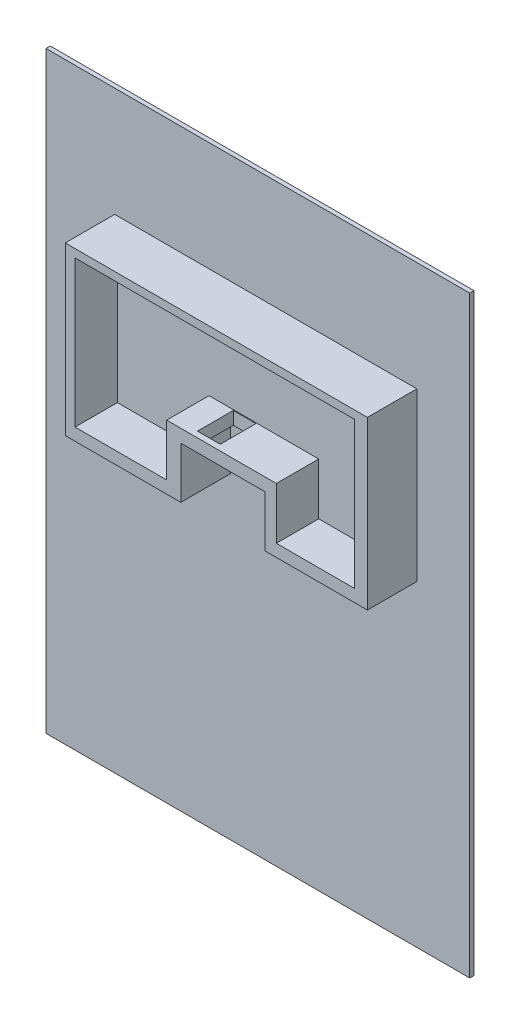
ISO-10303-21;
HEADER;
FILE_DESCRIPTION(('STEP AP214'),'2;1');
FILE_NAME('part.step','',(''),(''),'','','');
FILE_SCHEMA(('AUTOMOTIVE_DESIGN { 1 0 10303 214 1 1 1 1 }'));
ENDSEC;
DATA;
#1=APPLICATION_CONTEXT('core data for automotive mechanical design processes');
#2=APPLICATION_PROTOCOL_DEFINITION('international standard','automotive_design',2000,#1);
#3=PRODUCT_CONTEXT('',#1,'mechanical');
#4=PRODUCT('Part','Part','',(#3));
#5=PRODUCT_RELATED_PRODUCT_CATEGORY('part','',(#4));
#6=PRODUCT_DEFINITION_FORMATION('','',#4);
#7=PRODUCT_DEFINITION_CONTEXT('part definition',#1,'design');
#8=PRODUCT_DEFINITION('design','',#6,#7);
#9=PRODUCT_DEFINITION_SHAPE('','',#8);
#10=(LENGTH_UNIT() NAMED_UNIT(*) SI_UNIT(.MILLI.,.METRE.));
#11=(NAMED_UNIT(*) PLANE_ANGLE_UNIT() SI_UNIT($,.RADIAN.));
#12=(NAMED_UNIT(*) SI_UNIT($,.STERADIAN.) SOLID_ANGLE_UNIT());
#13=UNCERTAINTY_MEASURE_WITH_UNIT(LENGTH_MEASURE(1.E-05),#10,'distance_accuracy_value','');
#14=(GEOMETRIC_REPRESENTATION_CONTEXT(3) GLOBAL_UNCERTAINTY_ASSIGNED_CONTEXT((#13)) GLOBAL_UNIT_ASSIGNED_CONTEXT((#10,
#11,#12)) REPRESENTATION_CONTEXT('',''));
#15=CARTESIAN_POINT('',(0.,0.,0.));
#16=DIRECTION('',(0.,0.,1.));
#17=DIRECTION('',(1.,0.,0.));
#18=AXIS2_PLACEMENT_3D('',#15,#16,#17);
#19=CARTESIAN_POINT('',(0.,0.,300.));
#20=DIRECTION('',(0.,0.,1.));
#21=DIRECTION('',(1.,0.,0.));
#22=AXIS2_PLACEMENT_3D('',#19,#20,#21);
#23=PLANE('',#22);
#24=DIRECTION('',(0.,-1.,0.));
#25=VECTOR('',#24,1.);
#26=CARTESIAN_POINT('',(-13806.8006711639,5017.15265866209,300.));
#27=LINE('',#26,#25);
#28=CARTESIAN_POINT('',(-13806.8006711639,5017.15265866209,300.));
#29=VERTEX_POINT('',#28);
#30=CARTESIAN_POINT('',(-13806.8006711639,-36982.8473413379,300.));
#31=VERTEX_POINT('',#30);
#32=EDGE_CURVE('E350',#29,#31,#27,.T.);
#33=ORIENTED_EDGE('',*,*,#32,.T.);
#34=DIRECTION('',(1.,0.,0.));
#35=VECTOR('',#34,1.);
#36=CARTESIAN_POINT('',(-13806.8006711639,-36982.8473413379,300.));
#37=LINE('',#36,#35);
#38=CARTESIAN_POINT('',(16193.1993288361,-36982.8473413379,300.));
#39=VERTEX_POINT('',#38);
#40=EDGE_CURVE('E353',#31,#39,#37,.T.);
#41=ORIENTED_EDGE('',*,*,#40,.T.);
#42=DIRECTION('',(0.,1.,0.));
#43=VECTOR('',#42,1.);
#44=CARTESIAN_POINT('',(16193.1993288361,5017.15265866209,300.));
#45=LINE('',#44,#43);
#46=CARTESIAN_POINT('',(16193.1993288361,5017.15265866209,300.));
#47=VERTEX_POINT('',#46);
#48=EDGE_CURVE('E356',#39,#47,#45,.T.);
#49=ORIENTED_EDGE('',*,*,#48,.T.);
#50=DIRECTION('',(-1.,0.,0.));
#51=VECTOR('',#50,1.);
#52=CARTESIAN_POINT('',(-13806.8006711639,5017.15265866209,300.));
#53=LINE('',#52,#51);
#54=EDGE_CURVE('E358',#47,#29,#53,.T.);
#55=ORIENTED_EDGE('',*,*,#54,.T.);
#56=EDGE_LOOP('',(#33,#41,#49,#55));
#57=FACE_BOUND('',#56,.T.);
#58=DIRECTION('',(-1.,0.,0.));
#59=VECTOR('',#58,1.);
#60=CARTESIAN_POINT('',(0.,-14541.0624681403,300.));
#61=LINE('',#60,#59);
#62=CARTESIAN_POINT('',(-760.186628399339,-14541.0624681403,300.));
#63=VERTEX_POINT('',#62);
#64=CARTESIAN_POINT('',(-8945.80397300491,-14541.0624681403,300.));
#65=VERTEX_POINT('',#64);
#66=EDGE_CURVE('E343',#63,#65,#61,.T.);
#67=ORIENTED_EDGE('',*,*,#66,.T.);
#68=DIRECTION('',(0.,1.,0.));
#69=VECTOR('',#68,1.);
#70=CARTESIAN_POINT('',(-8945.80397300491,0.,300.));
#71=LINE('',#70,#69);
#72=CARTESIAN_POINT('',(-8945.80397300491,-2727.72834581182,300.));
#73=VERTEX_POINT('',#72);
#74=EDGE_CURVE('E346',#65,#73,#71,.T.);
#75=ORIENTED_EDGE('',*,*,#74,.T.);
#76=DIRECTION('',(1.,0.,0.));
#77=VECTOR('',#76,1.);
#78=CARTESIAN_POINT('',(0.,-2727.72834581182,300.));
#79=LINE('',#78,#77);
#80=CARTESIAN_POINT('',(12448.4231776688,-2727.72834581182,300.));
#81=VERTEX_POINT('',#80);
#82=EDGE_CURVE('E325',#73,#81,#79,.T.);
#83=ORIENTED_EDGE('',*,*,#82,.T.);
#84=DIRECTION('',(0.,-1.,0.));
#85=VECTOR('',#84,1.);
#86=CARTESIAN_POINT('',(12448.4231776688,0.,300.));
#87=LINE('',#86,#85);
#88=CARTESIAN_POINT('',(12448.4231776688,-14541.0624681403,300.));
#89=VERTEX_POINT('',#88);
#90=EDGE_CURVE('E328',#81,#89,#87,.T.);
#91=ORIENTED_EDGE('',*,*,#90,.T.);
#92=DIRECTION('',(-1.,0.,0.));
#93=VECTOR('',#92,1.);
#94=CARTESIAN_POINT('',(0.,-14541.0624681403,300.));
#95=LINE('',#94,#93);
#96=CARTESIAN_POINT('',(5192.98962222291,-14541.0624681403,300.));
#97=VERTEX_POINT('',#96);
#98=EDGE_CURVE('E331',#89,#97,#95,.T.);
#99=ORIENTED_EDGE('',*,*,#98,.T.);
#100=DIRECTION('',(0.,1.,0.));
#101=VECTOR('',#100,1.);
#102=CARTESIAN_POINT('',(5192.98962222291,0.,300.));
#103=LINE('',#102,#101);
#104=CARTESIAN_POINT('',(5192.98962222291,-10913.3456904174,300.));
#105=VERTEX_POINT('',#104);
#106=EDGE_CURVE('E334',#97,#105,#103,.T.);
#107=ORIENTED_EDGE('',*,*,#106,.T.);
#108=DIRECTION('',(-1.,0.,0.));
#109=VECTOR('',#108,1.);
#110=CARTESIAN_POINT('',(0.,-10913.3456904174,300.));
#111=LINE('',#110,#109);
#112=CARTESIAN_POINT('',(-760.186628399339,-10913.3456904174,300.));
#113=VERTEX_POINT('',#112);
#114=EDGE_CURVE('E337',#105,#113,#111,.T.);
#115=ORIENTED_EDGE('',*,*,#114,.T.);
#116=DIRECTION('',(0.,-1.,0.));
#117=VECTOR('',#116,1.);
#118=CARTESIAN_POINT('',(-760.186628399339,0.,300.));
#119=LINE('',#118,#117);
#120=EDGE_CURVE('E340',#113,#63,#119,.T.);
#121=ORIENTED_EDGE('',*,*,#120,.T.);
#122=EDGE_LOOP('',(#67,#75,#83,#91,#99,#107,#115,#121));
#123=FACE_BOUND('',#122,.T.);
#124=ADVANCED_FACE('F33',(#57,#123),#23,.T.);
#125=CARTESIAN_POINT('',(-13806.8006711639,5017.15265866209,300.));
#126=DIRECTION('',(1.,0.,0.));
#127=DIRECTION('',(0.,1.,0.));
#128=AXIS2_PLACEMENT_3D('',#125,#126,#127);
#129=PLANE('',#128);
#130=DIRECTION('',(0.,-1.,0.));
#131=VECTOR('',#130,1.);
#132=CARTESIAN_POINT('',(-13806.8006711639,5017.15265866209,0.));
#133=LINE('',#132,#131);
#134=CARTESIAN_POINT('',(-13806.8006711639,5017.15265866209,0.));
#135=VERTEX_POINT('',#134);
#136=CARTESIAN_POINT('',(-13806.8006711639,-36982.8473413379,0.));
#137=VERTEX_POINT('',#136);
#138=EDGE_CURVE('E349',#135,#137,#133,.T.);
#139=ORIENTED_EDGE('',*,*,#138,.T.);
#140=DIRECTION('',(0.,0.,-1.));
#141=VECTOR('',#140,1.);
#142=CARTESIAN_POINT('',(-13806.8006711639,-36982.8473413379,300.));
#143=LINE('',#142,#141);
#144=EDGE_CURVE('E376',#31,#137,#143,.T.);
#145=ORIENTED_EDGE('',*,*,#144,.F.);
#146=ORIENTED_EDGE('',*,*,#32,.F.);
#147=DIRECTION('',(0.,0.,-1.));
#148=VECTOR('',#147,1.);
#149=CARTESIAN_POINT('',(-13806.8006711639,5017.15265866209,300.));
#150=LINE('',#149,#148);
#151=EDGE_CURVE('E360',#29,#135,#150,.T.);
#152=ORIENTED_EDGE('',*,*,#151,.T.);
#153=EDGE_LOOP('',(#139,#145,#146,#152));
#154=FACE_BOUND('',#153,.T.);
#155=ADVANCED_FACE('F35',(#154),#129,.F.);
#156=CARTESIAN_POINT('',(-13806.8006711639,-36982.8473413379,300.));
#157=DIRECTION('',(0.,1.,0.));
#158=DIRECTION('',(0.,0.,1.));
#159=AXIS2_PLACEMENT_3D('',#156,#157,#158);
#160=PLANE('',#159);
#161=DIRECTION('',(1.,0.,0.));
#162=VECTOR('',#161,1.);
#163=CARTESIAN_POINT('',(-13806.8006711639,-36982.8473413379,0.));
#164=LINE('',#163,#162);
#165=CARTESIAN_POINT('',(16193.1993288361,-36982.8473413379,0.));
#166=VERTEX_POINT('',#165);
#167=EDGE_CURVE('E363',#137,#166,#164,.T.);
#168=ORIENTED_EDGE('',*,*,#167,.T.);
#169=DIRECTION('',(0.,0.,-1.));
#170=VECTOR('',#169,1.);
#171=CARTESIAN_POINT('',(16193.1993288361,-36982.8473413379,300.));
#172=LINE('',#171,#170);
#173=EDGE_CURVE('E373',#39,#166,#172,.T.);
#174=ORIENTED_EDGE('',*,*,#173,.F.);
#175=ORIENTED_EDGE('',*,*,#40,.F.);
#176=ORIENTED_EDGE('',*,*,#144,.T.);
#177=EDGE_LOOP('',(#168,#174,#175,#176));
#178=FACE_BOUND('',#177,.T.);
#179=ADVANCED_FACE('F409',(#178),#160,.F.);
#180=CARTESIAN_POINT('',(16193.1993288361,5017.15265866209,300.));
#181=DIRECTION('',(-1.,0.,0.));
#182=DIRECTION('',(0.,-1.,0.));
#183=AXIS2_PLACEMENT_3D('',#180,#181,#182);
#184=PLANE('',#183);
#185=DIRECTION('',(0.,1.,0.));
#186=VECTOR('',#185,1.);
#187=CARTESIAN_POINT('',(16193.1993288361,5017.15265866209,0.));
#188=LINE('',#187,#186);
#189=CARTESIAN_POINT('',(16193.1993288361,5017.15265866209,0.));
#190=VERTEX_POINT('',#189);
#191=EDGE_CURVE('E365',#166,#190,#188,.T.);
#192=ORIENTED_EDGE('',*,*,#191,.T.);
#193=DIRECTION('',(0.,0.,-1.));
#194=VECTOR('',#193,1.);
#195=CARTESIAN_POINT('',(16193.1993288361,5017.15265866209,300.));
#196=LINE('',#195,#194);
#197=EDGE_CURVE('E370',#47,#190,#196,.T.);
#198=ORIENTED_EDGE('',*,*,#197,.F.);
#199=ORIENTED_EDGE('',*,*,#48,.F.);
#200=ORIENTED_EDGE('',*,*,#173,.T.);
#201=EDGE_LOOP('',(#192,#198,#199,#200));
#202=FACE_BOUND('',#201,.T.);
#203=ADVANCED_FACE('F423',(#202),#184,.F.);
#204=CARTESIAN_POINT('',(-13806.8006711639,5017.15265866209,300.));
#205=DIRECTION('',(0.,-1.,0.));
#206=DIRECTION('',(0.,0.,-1.));
#207=AXIS2_PLACEMENT_3D('',#204,#205,#206);
#208=PLANE('',#207);
#209=DIRECTION('',(-1.,0.,0.));
#210=VECTOR('',#209,1.);
#211=CARTESIAN_POINT('',(-13806.8006711639,5017.15265866209,0.));
#212=LINE('',#211,#210);
#213=EDGE_CURVE('E354',#190,#135,#212,.T.);
#214=ORIENTED_EDGE('',*,*,#213,.T.);
#215=ORIENTED_EDGE('',*,*,#151,.F.);
#216=ORIENTED_EDGE('',*,*,#54,.F.);
#217=ORIENTED_EDGE('',*,*,#197,.T.);
#218=EDGE_LOOP('',(#214,#215,#216,#217));
#219=FACE_BOUND('',#218,.T.);
#220=ADVANCED_FACE('F419',(#219),#208,.F.);
#221=CARTESIAN_POINT('',(0.,0.,0.));
#222=DIRECTION('',(0.,0.,1.));
#223=DIRECTION('',(1.,0.,0.));
#224=AXIS2_PLACEMENT_3D('',#221,#222,#223);
#225=PLANE('',#224);
#226=ORIENTED_EDGE('',*,*,#138,.F.);
#227=ORIENTED_EDGE('',*,*,#213,.F.);
#228=ORIENTED_EDGE('',*,*,#191,.F.);
#229=ORIENTED_EDGE('',*,*,#167,.F.);
#230=EDGE_LOOP('',(#226,#227,#228,#229));
#231=FACE_BOUND('',#230,.T.);
#232=ADVANCED_FACE('F416',(#231),#225,.F.);
#233=CARTESIAN_POINT('',(-8945.80397300491,-2727.72834581182,800.));
#234=DIRECTION('',(1.,0.,0.));
#235=DIRECTION('',(0.,0.,-1.));
#236=AXIS2_PLACEMENT_3D('',#233,#234,#235);
#237=PLANE('',#236);
#238=ORIENTED_EDGE('',*,*,#74,.F.);
#239=DIRECTION('',(0.,0.,-1.));
#240=VECTOR('',#239,1.);
#241=CARTESIAN_POINT('',(-8945.80397300491,-14541.0624681403,800.));
#242=LINE('',#241,#240);
#243=CARTESIAN_POINT('',(-8945.80397300491,-14541.0624681403,3800.));
#244=VERTEX_POINT('',#243);
#245=EDGE_CURVE('E322',#244,#65,#242,.T.);
#246=ORIENTED_EDGE('',*,*,#245,.F.);
#247=DIRECTION('',(0.,-1.,0.));
#248=VECTOR('',#247,1.);
#249=CARTESIAN_POINT('',(-8945.80397300491,-14541.0624681403,3800.));
#250=LINE('',#249,#248);
#251=CARTESIAN_POINT('',(-8945.80397300491,-2727.72834581182,3800.));
#252=VERTEX_POINT('',#251);
#253=EDGE_CURVE('E278',#252,#244,#250,.T.);
#254=ORIENTED_EDGE('',*,*,#253,.F.);
#255=DIRECTION('',(0.,0.,-1.));
#256=VECTOR('',#255,1.);
#257=CARTESIAN_POINT('',(-8945.80397300491,-2727.72834581182,800.));
#258=LINE('',#257,#256);
#259=EDGE_CURVE('E302',#252,#73,#258,.T.);
#260=ORIENTED_EDGE('',*,*,#259,.T.);
#261=EDGE_LOOP('',(#238,#246,#254,#260));
#262=FACE_BOUND('',#261,.T.);
#263=ADVANCED_FACE('F414',(#262),#237,.F.);
#264=CARTESIAN_POINT('',(-8945.80397300491,-14541.0624681403,800.));
#265=DIRECTION('',(0.,1.,0.));
#266=DIRECTION('',(0.,0.,1.));
#267=AXIS2_PLACEMENT_3D('',#264,#265,#266);
#268=PLANE('',#267);
#269=ORIENTED_EDGE('',*,*,#66,.F.);
#270=DIRECTION('',(0.,0.,-1.));
#271=VECTOR('',#270,1.);
#272=CARTESIAN_POINT('',(-760.186628399339,-14541.0624681403,800.));
#273=LINE('',#272,#271);
#274=CARTESIAN_POINT('',(-760.186628399339,-14541.0624681403,3800.));
#275=VERTEX_POINT('',#274);
#276=EDGE_CURVE('E319',#275,#63,#273,.T.);
#277=ORIENTED_EDGE('',*,*,#276,.F.);
#278=DIRECTION('',(1.,0.,0.));
#279=VECTOR('',#278,1.);
#280=CARTESIAN_POINT('',(-760.186628399339,-14541.0624681403,3800.));
#281=LINE('',#280,#279);
#282=EDGE_CURVE('E281',#244,#275,#281,.T.);
#283=ORIENTED_EDGE('',*,*,#282,.F.);
#284=ORIENTED_EDGE('',*,*,#245,.T.);
#285=EDGE_LOOP('',(#269,#277,#283,#284));
#286=FACE_BOUND('',#285,.T.);
#287=ADVANCED_FACE('F461',(#286),#268,.F.);
#288=CARTESIAN_POINT('',(-760.186628399339,-14541.0624681403,800.));
#289=DIRECTION('',(-1.,0.,0.));
#290=DIRECTION('',(0.,0.,1.));
#291=AXIS2_PLACEMENT_3D('',#288,#289,#290);
#292=PLANE('',#291);
#293=ORIENTED_EDGE('',*,*,#120,.F.);
#294=DIRECTION('',(0.,0.,-1.));
#295=VECTOR('',#294,1.);
#296=CARTESIAN_POINT('',(-760.186628399339,-10913.3456904174,800.));
#297=LINE('',#296,#295);
#298=CARTESIAN_POINT('',(-760.186628399339,-10913.3456904174,3800.));
#299=VERTEX_POINT('',#298);
#300=EDGE_CURVE('E316',#299,#113,#297,.T.);
#301=ORIENTED_EDGE('',*,*,#300,.F.);
#302=DIRECTION('',(0.,1.,0.));
#303=VECTOR('',#302,1.);
#304=CARTESIAN_POINT('',(-760.186628399339,-10913.3456904174,3800.));
#305=LINE('',#304,#303);
#306=EDGE_CURVE('E284',#275,#299,#305,.T.);
#307=ORIENTED_EDGE('',*,*,#306,.F.);
#308=ORIENTED_EDGE('',*,*,#276,.T.);
#309=EDGE_LOOP('',(#293,#301,#307,#308));
#310=FACE_BOUND('',#309,.T.);
#311=ADVANCED_FACE('F468',(#310),#292,.F.);
#312=CARTESIAN_POINT('',(-760.186628399339,-10913.3456904174,800.));
#313=DIRECTION('',(0.,1.,0.));
#314=DIRECTION('',(0.,0.,1.));
#315=AXIS2_PLACEMENT_3D('',#312,#313,#314);
#316=PLANE('',#315);
#317=DIRECTION('',(1.,0.,0.));
#318=VECTOR('',#317,1.);
#319=CARTESIAN_POINT('',(0.,-10913.3456904174,848.181238739196));
#320=LINE('',#319,#318);
#321=CARTESIAN_POINT('',(0.,-10913.3456904174,848.181238739196));
#322=VERTEX_POINT('',#321);
#323=CARTESIAN_POINT('',(1609.78482453726,-10913.3456904174,848.181238739196));
#324=VERTEX_POINT('',#323);
#325=EDGE_CURVE('E205',#322,#324,#320,.T.);
#326=ORIENTED_EDGE('',*,*,#325,.F.);
#327=DIRECTION('',(0.,0.,-1.));
#328=VECTOR('',#327,1.);
#329=CARTESIAN_POINT('',(0.,-10913.3456904174,3382.21665404866));
#330=LINE('',#329,#328);
#331=CARTESIAN_POINT('',(0.,-10913.3456904174,3382.21665404866));
#332=VERTEX_POINT('',#331);
#333=EDGE_CURVE('E48',#332,#322,#330,.T.);
#334=ORIENTED_EDGE('',*,*,#333,.F.);
#335=DIRECTION('',(-1.,0.,0.));
#336=VECTOR('',#335,1.);
#337=CARTESIAN_POINT('',(0.,-10913.3456904174,3382.21665404866));
#338=LINE('',#337,#336);
#339=CARTESIAN_POINT('',(1609.78482453726,-10913.3456904174,3382.21665404866));
#340=VERTEX_POINT('',#339);
#341=EDGE_CURVE('E212',#340,#332,#338,.T.);
#342=ORIENTED_EDGE('',*,*,#341,.F.);
#343=DIRECTION('',(0.,0.,1.));
#344=VECTOR('',#343,1.);
#345=CARTESIAN_POINT('',(1609.78482453726,-10913.3456904174,3382.21665404866));
#346=LINE('',#345,#344);
#347=EDGE_CURVE('E196',#324,#340,#346,.T.);
#348=ORIENTED_EDGE('',*,*,#347,.F.);
#349=EDGE_LOOP('',(#326,#334,#342,#348));
#350=FACE_BOUND('',#349,.T.);
#351=ORIENTED_EDGE('',*,*,#114,.F.);
#352=DIRECTION('',(0.,0.,-1.));
#353=VECTOR('',#352,1.);
#354=CARTESIAN_POINT('',(5192.98962222291,-10913.3456904174,800.));
#355=LINE('',#354,#353);
#356=CARTESIAN_POINT('',(5192.98962222291,-10913.3456904174,3800.));
#357=VERTEX_POINT('',#356);
#358=EDGE_CURVE('E313',#357,#105,#355,.T.);
#359=ORIENTED_EDGE('',*,*,#358,.F.);
#360=DIRECTION('',(1.,0.,0.));
#361=VECTOR('',#360,1.);
#362=CARTESIAN_POINT('',(5192.98962222291,-10913.3456904174,3800.));
#363=LINE('',#362,#361);
#364=EDGE_CURVE('E287',#299,#357,#363,.T.);
#365=ORIENTED_EDGE('',*,*,#364,.F.);
#366=ORIENTED_EDGE('',*,*,#300,.T.);
#367=EDGE_LOOP('',(#351,#359,#365,#366));
#368=FACE_BOUND('',#367,.T.);
#369=ADVANCED_FACE('F209',(#350,#368),#316,.F.);
#370=CARTESIAN_POINT('',(5192.98962222291,-10913.3456904174,800.));
#371=DIRECTION('',(1.,0.,0.));
#372=DIRECTION('',(0.,0.,-1.));
#373=AXIS2_PLACEMENT_3D('',#370,#371,#372);
#374=PLANE('',#373);
#375=ORIENTED_EDGE('',*,*,#106,.F.);
#376=DIRECTION('',(0.,0.,-1.));
#377=VECTOR('',#376,1.);
#378=CARTESIAN_POINT('',(5192.98962222291,-14541.0624681403,800.));
#379=LINE('',#378,#377);
#380=CARTESIAN_POINT('',(5192.98962222291,-14541.0624681403,3800.));
#381=VERTEX_POINT('',#380);
#382=EDGE_CURVE('E310',#381,#97,#379,.T.);
#383=ORIENTED_EDGE('',*,*,#382,.F.);
#384=DIRECTION('',(0.,-1.,0.));
#385=VECTOR('',#384,1.);
#386=CARTESIAN_POINT('',(5192.98962222291,-14541.0624681403,3800.));
#387=LINE('',#386,#385);
#388=EDGE_CURVE('E290',#357,#381,#387,.T.);
#389=ORIENTED_EDGE('',*,*,#388,.F.);
#390=ORIENTED_EDGE('',*,*,#358,.T.);
#391=EDGE_LOOP('',(#375,#383,#389,#390));
#392=FACE_BOUND('',#391,.T.);
#393=ADVANCED_FACE('F483',(#392),#374,.F.);
#394=CARTESIAN_POINT('',(5192.98962222291,-14541.0624681403,800.));
#395=DIRECTION('',(0.,1.,0.));
#396=DIRECTION('',(0.,0.,1.));
#397=AXIS2_PLACEMENT_3D('',#394,#395,#396);
#398=PLANE('',#397);
#399=ORIENTED_EDGE('',*,*,#98,.F.);
#400=DIRECTION('',(0.,0.,-1.));
#401=VECTOR('',#400,1.);
#402=CARTESIAN_POINT('',(12448.4231776688,-14541.0624681403,800.));
#403=LINE('',#402,#401);
#404=CARTESIAN_POINT('',(12448.4231776688,-14541.0624681403,3800.));
#405=VERTEX_POINT('',#404);
#406=EDGE_CURVE('E307',#405,#89,#403,.T.);
#407=ORIENTED_EDGE('',*,*,#406,.F.);
#408=DIRECTION('',(1.,0.,0.));
#409=VECTOR('',#408,1.);
#410=CARTESIAN_POINT('',(12448.4231776688,-14541.0624681403,3800.));
#411=LINE('',#410,#409);
#412=EDGE_CURVE('E293',#381,#405,#411,.T.);
#413=ORIENTED_EDGE('',*,*,#412,.F.);
#414=ORIENTED_EDGE('',*,*,#382,.T.);
#415=EDGE_LOOP('',(#399,#407,#413,#414));
#416=FACE_BOUND('',#415,.T.);
#417=ADVANCED_FACE('F491',(#416),#398,.F.);
#418=CARTESIAN_POINT('',(12448.4231776688,-14541.0624681403,800.));
#419=DIRECTION('',(-1.,0.,0.));
#420=DIRECTION('',(0.,0.,1.));
#421=AXIS2_PLACEMENT_3D('',#418,#419,#420);
#422=PLANE('',#421);
#423=ORIENTED_EDGE('',*,*,#90,.F.);
#424=DIRECTION('',(0.,0.,-1.));
#425=VECTOR('',#424,1.);
#426=CARTESIAN_POINT('',(12448.4231776688,-2727.72834581182,800.));
#427=LINE('',#426,#425);
#428=CARTESIAN_POINT('',(12448.4231776688,-2727.72834581182,3800.));
#429=VERTEX_POINT('',#428);
#430=EDGE_CURVE('E305',#429,#81,#427,.T.);
#431=ORIENTED_EDGE('',*,*,#430,.F.);
#432=DIRECTION('',(0.,1.,0.));
#433=VECTOR('',#432,1.);
#434=CARTESIAN_POINT('',(12448.4231776688,-2727.72834581182,3800.));
#435=LINE('',#434,#433);
#436=EDGE_CURVE('E296',#405,#429,#435,.T.);
#437=ORIENTED_EDGE('',*,*,#436,.F.);
#438=ORIENTED_EDGE('',*,*,#406,.T.);
#439=EDGE_LOOP('',(#423,#431,#437,#438));
#440=FACE_BOUND('',#439,.T.);
#441=ADVANCED_FACE('F499',(#440),#422,.F.);
#442=CARTESIAN_POINT('',(12448.4231776688,-2727.72834581182,800.));
#443=DIRECTION('',(0.,-1.,0.));
#444=DIRECTION('',(0.,0.,-1.));
#445=AXIS2_PLACEMENT_3D('',#442,#443,#444);
#446=PLANE('',#445);
#447=ORIENTED_EDGE('',*,*,#82,.F.);
#448=ORIENTED_EDGE('',*,*,#259,.F.);
#449=DIRECTION('',(-1.,0.,0.));
#450=VECTOR('',#449,1.);
#451=CARTESIAN_POINT('',(-8945.80397300491,-2727.72834581182,3800.));
#452=LINE('',#451,#450);
#453=EDGE_CURVE('E299',#429,#252,#452,.T.);
#454=ORIENTED_EDGE('',*,*,#453,.F.);
#455=ORIENTED_EDGE('',*,*,#430,.T.);
#456=EDGE_LOOP('',(#447,#448,#454,#455));
#457=FACE_BOUND('',#456,.T.);
#458=ADVANCED_FACE('F507',(#457),#446,.F.);
#459=CARTESIAN_POINT('',(0.,0.,3800.));
#460=DIRECTION('',(0.,0.,-1.));
#461=DIRECTION('',(-1.,0.,0.));
#462=AXIS2_PLACEMENT_3D('',#459,#460,#461);
#463=PLANE('',#462);
#464=ORIENTED_EDGE('',*,*,#253,.T.);
#465=ORIENTED_EDGE('',*,*,#282,.T.);
#466=ORIENTED_EDGE('',*,*,#306,.T.);
#467=ORIENTED_EDGE('',*,*,#364,.T.);
#468=ORIENTED_EDGE('',*,*,#388,.T.);
#469=ORIENTED_EDGE('',*,*,#412,.T.);
#470=ORIENTED_EDGE('',*,*,#436,.T.);
#471=ORIENTED_EDGE('',*,*,#453,.T.);
#472=EDGE_LOOP('',(#464,#465,#466,#467,#468,#469,#470,#471));
#473=FACE_BOUND('',#472,.T.);
#474=DIRECTION('',(0.,-1.,0.));
#475=VECTOR('',#474,1.);
#476=CARTESIAN_POINT('',(-8253.93096842304,-13673.1920235571,3800.));
#477=LINE('',#476,#475);
#478=CARTESIAN_POINT('',(-8253.93096842304,-3301.78555763782,3800.));
#479=VERTEX_POINT('',#478);
#480=CARTESIAN_POINT('',(-8253.93096842304,-13673.1920235571,3800.));
#481=VERTEX_POINT('',#480);
#482=EDGE_CURVE('E222',#479,#481,#477,.T.);
#483=ORIENTED_EDGE('',*,*,#482,.F.);
#484=DIRECTION('',(-1.,0.,0.));
#485=VECTOR('',#484,1.);
#486=CARTESIAN_POINT('',(-8253.93096842304,-3301.78555763782,3800.));
#487=LINE('',#486,#485);
#488=CARTESIAN_POINT('',(11531.5213665615,-3301.78555763782,3800.));
#489=VERTEX_POINT('',#488);
#490=EDGE_CURVE('E238',#489,#479,#487,.T.);
#491=ORIENTED_EDGE('',*,*,#490,.F.);
#492=DIRECTION('',(0.,1.,0.));
#493=VECTOR('',#492,1.);
#494=CARTESIAN_POINT('',(11531.5213665615,-3301.78555763782,3800.));
#495=LINE('',#494,#493);
#496=CARTESIAN_POINT('',(11531.5213665615,-13673.1920235571,3800.));
#497=VERTEX_POINT('',#496);
#498=EDGE_CURVE('E235',#497,#489,#495,.T.);
#499=ORIENTED_EDGE('',*,*,#498,.F.);
#500=DIRECTION('',(1.,0.,0.));
#501=VECTOR('',#500,1.);
#502=CARTESIAN_POINT('',(11531.5213665615,-13673.1920235571,3800.));
#503=LINE('',#502,#501);
#504=CARTESIAN_POINT('',(6000.10458473785,-13673.1920235571,3800.));
#505=VERTEX_POINT('',#504);
#506=EDGE_CURVE('E233',#505,#497,#503,.T.);
#507=ORIENTED_EDGE('',*,*,#506,.F.);
#508=DIRECTION('',(0.,-1.,0.));
#509=VECTOR('',#508,1.);
#510=CARTESIAN_POINT('',(6000.10458473785,-13673.1920235571,3800.));
#511=LINE('',#510,#509);
#512=CARTESIAN_POINT('',(6000.10458473785,-10003.3097356164,3800.));
#513=VERTEX_POINT('',#512);
#514=EDGE_CURVE('E231',#513,#505,#511,.T.);
#515=ORIENTED_EDGE('',*,*,#514,.F.);
#516=DIRECTION('',(1.,0.,0.));
#517=VECTOR('',#516,1.);
#518=CARTESIAN_POINT('',(6000.10458473785,-10003.3097356164,3800.));
#519=LINE('',#518,#517);
#520=CARTESIAN_POINT('',(-1765.15358974532,-10003.3097356164,3800.));
#521=VERTEX_POINT('',#520);
#522=EDGE_CURVE('E229',#521,#513,#519,.T.);
#523=ORIENTED_EDGE('',*,*,#522,.F.);
#524=DIRECTION('',(0.,1.,0.));
#525=VECTOR('',#524,1.);
#526=CARTESIAN_POINT('',(-1765.15358974532,-10003.3097356164,3800.));
#527=LINE('',#526,#525);
#528=CARTESIAN_POINT('',(-1765.15358974532,-13673.1920235571,3800.));
#529=VERTEX_POINT('',#528);
#530=EDGE_CURVE('E227',#529,#521,#527,.T.);
#531=ORIENTED_EDGE('',*,*,#530,.F.);
#532=DIRECTION('',(1.,0.,0.));
#533=VECTOR('',#532,1.);
#534=CARTESIAN_POINT('',(-1765.15358974532,-13673.1920235571,3800.));
#535=LINE('',#534,#533);
#536=EDGE_CURVE('E224',#481,#529,#535,.T.);
#537=ORIENTED_EDGE('',*,*,#536,.F.);
#538=EDGE_LOOP('',(#483,#491,#499,#507,#515,#523,#531,#537));
#539=FACE_BOUND('',#538,.T.);
#540=ADVANCED_FACE('F515',(#473,#539),#463,.F.);
#541=CARTESIAN_POINT('',(-8253.93096842304,-13673.1920235571,3800.));
#542=DIRECTION('',(1.,0.,0.));
#543=DIRECTION('',(0.,0.,-1.));
#544=AXIS2_PLACEMENT_3D('',#541,#542,#543);
#545=PLANE('',#544);
#546=DIRECTION('',(0.,-1.,0.));
#547=VECTOR('',#546,1.);
#548=CARTESIAN_POINT('',(-8253.93096842304,-13673.1920235571,800.));
#549=LINE('',#548,#547);
#550=CARTESIAN_POINT('',(-8253.93096842304,-3301.78555763782,800.));
#551=VERTEX_POINT('',#550);
#552=CARTESIAN_POINT('',(-8253.93096842304,-13673.1920235571,800.));
#553=VERTEX_POINT('',#552);
#554=EDGE_CURVE('E219',#551,#553,#549,.T.);
#555=ORIENTED_EDGE('',*,*,#554,.F.);
#556=DIRECTION('',(0.,0.,-1.));
#557=VECTOR('',#556,1.);
#558=CARTESIAN_POINT('',(-8253.93096842304,-3301.78555763782,3800.));
#559=LINE('',#558,#557);
#560=EDGE_CURVE('E240',#479,#551,#559,.T.);
#561=ORIENTED_EDGE('',*,*,#560,.F.);
#562=ORIENTED_EDGE('',*,*,#482,.T.);
#563=DIRECTION('',(0.,0.,-1.));
#564=VECTOR('',#563,1.);
#565=CARTESIAN_POINT('',(-8253.93096842304,-13673.1920235571,3800.));
#566=LINE('',#565,#564);
#567=EDGE_CURVE('E275',#481,#553,#566,.T.);
#568=ORIENTED_EDGE('',*,*,#567,.T.);
#569=EDGE_LOOP('',(#555,#561,#562,#568));
#570=FACE_BOUND('',#569,.T.);
#571=ADVANCED_FACE('F523',(#570),#545,.T.);
#572=CARTESIAN_POINT('',(-1765.15358974532,-13673.1920235571,3800.));
#573=DIRECTION('',(0.,1.,0.));
#574=DIRECTION('',(0.,0.,1.));
#575=AXIS2_PLACEMENT_3D('',#572,#573,#574);
#576=PLANE('',#575);
#577=DIRECTION('',(1.,0.,0.));
#578=VECTOR('',#577,1.);
#579=CARTESIAN_POINT('',(-1765.15358974532,-13673.1920235571,800.));
#580=LINE('',#579,#578);
#581=CARTESIAN_POINT('',(-1765.15358974532,-13673.1920235571,800.));
#582=VERTEX_POINT('',#581);
#583=EDGE_CURVE('E242',#553,#582,#580,.T.);
#584=ORIENTED_EDGE('',*,*,#583,.F.);
#585=ORIENTED_EDGE('',*,*,#567,.F.);
#586=ORIENTED_EDGE('',*,*,#536,.T.);
#587=DIRECTION('',(0.,0.,-1.));
#588=VECTOR('',#587,1.);
#589=CARTESIAN_POINT('',(-1765.15358974532,-13673.1920235571,3800.));
#590=LINE('',#589,#588);
#591=EDGE_CURVE('E272',#529,#582,#590,.T.);
#592=ORIENTED_EDGE('',*,*,#591,.T.);
#593=EDGE_LOOP('',(#584,#585,#586,#592));
#594=FACE_BOUND('',#593,.T.);
#595=ADVANCED_FACE('F531',(#594),#576,.T.);
#596=CARTESIAN_POINT('',(-1765.15358974532,-10003.3097356164,3800.));
#597=DIRECTION('',(-1.,0.,0.));
#598=DIRECTION('',(0.,0.,1.));
#599=AXIS2_PLACEMENT_3D('',#596,#597,#598);
#600=PLANE('',#599);
#601=DIRECTION('',(0.,1.,0.));
#602=VECTOR('',#601,1.);
#603=CARTESIAN_POINT('',(-1765.15358974532,-10003.3097356164,800.));
#604=LINE('',#603,#602);
#605=CARTESIAN_POINT('',(-1765.15358974532,-10003.3097356164,800.));
#606=VERTEX_POINT('',#605);
#607=EDGE_CURVE('E244',#582,#606,#604,.T.);
#608=ORIENTED_EDGE('',*,*,#607,.F.);
#609=ORIENTED_EDGE('',*,*,#591,.F.);
#610=ORIENTED_EDGE('',*,*,#530,.T.);
#611=DIRECTION('',(0.,0.,-1.));
#612=VECTOR('',#611,1.);
#613=CARTESIAN_POINT('',(-1765.15358974532,-10003.3097356164,3800.));
#614=LINE('',#613,#612);
#615=EDGE_CURVE('E269',#521,#606,#614,.T.);
#616=ORIENTED_EDGE('',*,*,#615,.T.);
#617=EDGE_LOOP('',(#608,#609,#610,#616));
#618=FACE_BOUND('',#617,.T.);
#619=ADVANCED_FACE('F539',(#618),#600,.T.);
#620=CARTESIAN_POINT('',(6000.10458473785,-10003.3097356164,3800.));
#621=DIRECTION('',(0.,1.,0.));
#622=DIRECTION('',(0.,0.,1.));
#623=AXIS2_PLACEMENT_3D('',#620,#621,#622);
#624=PLANE('',#623);
#625=DIRECTION('',(0.,0.,1.));
#626=VECTOR('',#625,1.);
#627=CARTESIAN_POINT('',(0.,-10003.3097356164,3800.));
#628=LINE('',#627,#626);
#629=CARTESIAN_POINT('',(0.,-10003.3097356164,848.181238739196));
#630=VERTEX_POINT('',#629);
#631=CARTESIAN_POINT('',(0.,-10003.3097356164,3382.21665404866));
#632=VERTEX_POINT('',#631);
#633=EDGE_CURVE('E11',#630,#632,#628,.T.);
#634=ORIENTED_EDGE('',*,*,#633,.F.);
#635=DIRECTION('',(-1.,0.,0.));
#636=VECTOR('',#635,1.);
#637=CARTESIAN_POINT('',(6000.10458473785,-10003.3097356164,848.181238739196));
#638=LINE('',#637,#636);
#639=CARTESIAN_POINT('',(1609.78482453726,-10003.3097356164,848.181238739196));
#640=VERTEX_POINT('',#639);
#641=EDGE_CURVE('E379',#640,#630,#638,.T.);
#642=ORIENTED_EDGE('',*,*,#641,.F.);
#643=DIRECTION('',(0.,0.,-1.));
#644=VECTOR('',#643,1.);
#645=CARTESIAN_POINT('',(1609.78482453726,-10003.3097356164,3800.));
#646=LINE('',#645,#644);
#647=CARTESIAN_POINT('',(1609.78482453726,-10003.3097356164,3382.21665404866));
#648=VERTEX_POINT('',#647);
#649=EDGE_CURVE('E199',#648,#640,#646,.T.);
#650=ORIENTED_EDGE('',*,*,#649,.F.);
#651=DIRECTION('',(1.,0.,0.));
#652=VECTOR('',#651,1.);
#653=CARTESIAN_POINT('',(6000.10458473785,-10003.3097356164,3382.21665404866));
#654=LINE('',#653,#652);
#655=EDGE_CURVE('E41',#632,#648,#654,.T.);
#656=ORIENTED_EDGE('',*,*,#655,.F.);
#657=EDGE_LOOP('',(#634,#642,#650,#656));
#658=FACE_BOUND('',#657,.T.);
#659=DIRECTION('',(1.,0.,0.));
#660=VECTOR('',#659,1.);
#661=CARTESIAN_POINT('',(6000.10458473785,-10003.3097356164,800.));
#662=LINE('',#661,#660);
#663=CARTESIAN_POINT('',(6000.10458473785,-10003.3097356164,800.));
#664=VERTEX_POINT('',#663);
#665=EDGE_CURVE('E246',#606,#664,#662,.T.);
#666=ORIENTED_EDGE('',*,*,#665,.F.);
#667=ORIENTED_EDGE('',*,*,#615,.F.);
#668=ORIENTED_EDGE('',*,*,#522,.T.);
#669=DIRECTION('',(0.,0.,-1.));
#670=VECTOR('',#669,1.);
#671=CARTESIAN_POINT('',(6000.10458473785,-10003.3097356164,3800.));
#672=LINE('',#671,#670);
#673=EDGE_CURVE('E266',#513,#664,#672,.T.);
#674=ORIENTED_EDGE('',*,*,#673,.T.);
#675=EDGE_LOOP('',(#666,#667,#668,#674));
#676=FACE_BOUND('',#675,.T.);
#677=ADVANCED_FACE('F387',(#658,#676),#624,.T.);
#678=CARTESIAN_POINT('',(6000.10458473785,-13673.1920235571,3800.));
#679=DIRECTION('',(1.,0.,0.));
#680=DIRECTION('',(0.,0.,-1.));
#681=AXIS2_PLACEMENT_3D('',#678,#679,#680);
#682=PLANE('',#681);
#683=DIRECTION('',(0.,-1.,0.));
#684=VECTOR('',#683,1.);
#685=CARTESIAN_POINT('',(6000.10458473785,-13673.1920235571,800.));
#686=LINE('',#685,#684);
#687=CARTESIAN_POINT('',(6000.10458473785,-13673.1920235571,800.));
#688=VERTEX_POINT('',#687);
#689=EDGE_CURVE('E248',#664,#688,#686,.T.);
#690=ORIENTED_EDGE('',*,*,#689,.F.);
#691=ORIENTED_EDGE('',*,*,#673,.F.);
#692=ORIENTED_EDGE('',*,*,#514,.T.);
#693=DIRECTION('',(0.,0.,-1.));
#694=VECTOR('',#693,1.);
#695=CARTESIAN_POINT('',(6000.10458473785,-13673.1920235571,3800.));
#696=LINE('',#695,#694);
#697=EDGE_CURVE('E263',#505,#688,#696,.T.);
#698=ORIENTED_EDGE('',*,*,#697,.T.);
#699=EDGE_LOOP('',(#690,#691,#692,#698));
#700=FACE_BOUND('',#699,.T.);
#701=ADVANCED_FACE('F554',(#700),#682,.T.);
#702=CARTESIAN_POINT('',(11531.5213665615,-13673.1920235571,3800.));
#703=DIRECTION('',(0.,1.,0.));
#704=DIRECTION('',(0.,0.,1.));
#705=AXIS2_PLACEMENT_3D('',#702,#703,#704);
#706=PLANE('',#705);
#707=DIRECTION('',(1.,0.,0.));
#708=VECTOR('',#707,1.);
#709=CARTESIAN_POINT('',(11531.5213665615,-13673.1920235571,800.));
#710=LINE('',#709,#708);
#711=CARTESIAN_POINT('',(11531.5213665615,-13673.1920235571,800.));
#712=VERTEX_POINT('',#711);
#713=EDGE_CURVE('E250',#688,#712,#710,.T.);
#714=ORIENTED_EDGE('',*,*,#713,.F.);
#715=ORIENTED_EDGE('',*,*,#697,.F.);
#716=ORIENTED_EDGE('',*,*,#506,.T.);
#717=DIRECTION('',(0.,0.,-1.));
#718=VECTOR('',#717,1.);
#719=CARTESIAN_POINT('',(11531.5213665615,-13673.1920235571,3800.));
#720=LINE('',#719,#718);
#721=EDGE_CURVE('E260',#497,#712,#720,.T.);
#722=ORIENTED_EDGE('',*,*,#721,.T.);
#723=EDGE_LOOP('',(#714,#715,#716,#722));
#724=FACE_BOUND('',#723,.T.);
#725=ADVANCED_FACE('F560',(#724),#706,.T.);
#726=CARTESIAN_POINT('',(11531.5213665615,-3301.78555763782,3800.));
#727=DIRECTION('',(-1.,0.,0.));
#728=DIRECTION('',(0.,0.,1.));
#729=AXIS2_PLACEMENT_3D('',#726,#727,#728);
#730=PLANE('',#729);
#731=DIRECTION('',(0.,1.,0.));
#732=VECTOR('',#731,1.);
#733=CARTESIAN_POINT('',(11531.5213665615,-3301.78555763782,800.));
#734=LINE('',#733,#732);
#735=CARTESIAN_POINT('',(11531.5213665615,-3301.78555763782,800.));
#736=VERTEX_POINT('',#735);
#737=EDGE_CURVE('E252',#712,#736,#734,.T.);
#738=ORIENTED_EDGE('',*,*,#737,.F.);
#739=ORIENTED_EDGE('',*,*,#721,.F.);
#740=ORIENTED_EDGE('',*,*,#498,.T.);
#741=DIRECTION('',(0.,0.,-1.));
#742=VECTOR('',#741,1.);
#743=CARTESIAN_POINT('',(11531.5213665615,-3301.78555763782,3800.));
#744=LINE('',#743,#742);
#745=EDGE_CURVE('E257',#489,#736,#744,.T.);
#746=ORIENTED_EDGE('',*,*,#745,.T.);
#747=EDGE_LOOP('',(#738,#739,#740,#746));
#748=FACE_BOUND('',#747,.T.);
#749=ADVANCED_FACE('F568',(#748),#730,.T.);
#750=CARTESIAN_POINT('',(-8253.93096842304,-3301.78555763782,3800.));
#751=DIRECTION('',(0.,-1.,0.));
#752=DIRECTION('',(0.,0.,-1.));
#753=AXIS2_PLACEMENT_3D('',#750,#751,#752);
#754=PLANE('',#753);
#755=DIRECTION('',(-1.,0.,0.));
#756=VECTOR('',#755,1.);
#757=CARTESIAN_POINT('',(-8253.93096842304,-3301.78555763782,800.));
#758=LINE('',#757,#756);
#759=EDGE_CURVE('E225',#736,#551,#758,.T.);
#760=ORIENTED_EDGE('',*,*,#759,.F.);
#761=ORIENTED_EDGE('',*,*,#745,.F.);
#762=ORIENTED_EDGE('',*,*,#490,.T.);
#763=ORIENTED_EDGE('',*,*,#560,.T.);
#764=EDGE_LOOP('',(#760,#761,#762,#763));
#765=FACE_BOUND('',#764,.T.);
#766=ADVANCED_FACE('F398',(#765),#754,.T.);
#767=CARTESIAN_POINT('',(0.,0.,800.));
#768=DIRECTION('',(0.,0.,1.));
#769=DIRECTION('',(1.,0.,0.));
#770=AXIS2_PLACEMENT_3D('',#767,#768,#769);
#771=PLANE('',#770);
#772=ORIENTED_EDGE('',*,*,#554,.T.);
#773=ORIENTED_EDGE('',*,*,#583,.T.);
#774=ORIENTED_EDGE('',*,*,#607,.T.);
#775=ORIENTED_EDGE('',*,*,#665,.T.);
#776=ORIENTED_EDGE('',*,*,#689,.T.);
#777=ORIENTED_EDGE('',*,*,#713,.T.);
#778=ORIENTED_EDGE('',*,*,#737,.T.);
#779=ORIENTED_EDGE('',*,*,#759,.T.);
#780=EDGE_LOOP('',(#772,#773,#774,#775,#776,#777,#778,#779));
#781=FACE_BOUND('',#780,.T.);
#782=ADVANCED_FACE('F391',(#781),#771,.T.);
#783=CARTESIAN_POINT('',(0.,-8851.34569041741,3382.21665404866));
#784=DIRECTION('',(-1.,0.,0.));
#785=DIRECTION('',(0.,0.,1.));
#786=AXIS2_PLACEMENT_3D('',#783,#784,#785);
#787=PLANE('',#786);
#788=ORIENTED_EDGE('',*,*,#633,.T.);
#789=DIRECTION('',(0.,-1.,0.));
#790=VECTOR('',#789,1.);
#791=CARTESIAN_POINT('',(0.,-8851.34569041741,3382.21665404866));
#792=LINE('',#791,#790);
#793=EDGE_CURVE('E217',#632,#332,#792,.T.);
#794=ORIENTED_EDGE('',*,*,#793,.T.);
#795=ORIENTED_EDGE('',*,*,#333,.T.);
#796=DIRECTION('',(0.,-1.,0.));
#797=VECTOR('',#796,1.);
#798=CARTESIAN_POINT('',(0.,-8851.34569041741,848.181238739196));
#799=LINE('',#798,#797);
#800=EDGE_CURVE('E202',#630,#322,#799,.T.);
#801=ORIENTED_EDGE('',*,*,#800,.F.);
#802=EDGE_LOOP('',(#788,#794,#795,#801));
#803=FACE_BOUND('',#802,.T.);
#804=ADVANCED_FACE('F389',(#803),#787,.F.);
#805=CARTESIAN_POINT('',(0.,-8851.34569041741,3382.21665404866));
#806=DIRECTION('',(0.,0.,1.));
#807=DIRECTION('',(1.,0.,0.));
#808=AXIS2_PLACEMENT_3D('',#805,#806,#807);
#809=PLANE('',#808);
#810=ORIENTED_EDGE('',*,*,#655,.T.);
#811=DIRECTION('',(0.,-1.,0.));
#812=VECTOR('',#811,1.);
#813=CARTESIAN_POINT('',(1609.78482453726,-8851.34569041741,3382.21665404866));
#814=LINE('',#813,#812);
#815=EDGE_CURVE('E201',#648,#340,#814,.T.);
#816=ORIENTED_EDGE('',*,*,#815,.T.);
#817=ORIENTED_EDGE('',*,*,#341,.T.);
#818=ORIENTED_EDGE('',*,*,#793,.F.);
#819=EDGE_LOOP('',(#810,#816,#817,#818));
#820=FACE_BOUND('',#819,.T.);
#821=ADVANCED_FACE('F384',(#820),#809,.F.);
#822=CARTESIAN_POINT('',(1609.78482453726,-8851.34569041741,3382.21665404866));
#823=DIRECTION('',(1.,0.,0.));
#824=DIRECTION('',(0.,0.,-1.));
#825=AXIS2_PLACEMENT_3D('',#822,#823,#824);
#826=PLANE('',#825);
#827=ORIENTED_EDGE('',*,*,#649,.T.);
#828=DIRECTION('',(0.,-1.,0.));
#829=VECTOR('',#828,1.);
#830=CARTESIAN_POINT('',(1609.78482453726,-8851.34569041741,848.181238739196));
#831=LINE('',#830,#829);
#832=EDGE_CURVE('E56',#640,#324,#831,.T.);
#833=ORIENTED_EDGE('',*,*,#832,.T.);
#834=ORIENTED_EDGE('',*,*,#347,.T.);
#835=ORIENTED_EDGE('',*,*,#815,.F.);
#836=EDGE_LOOP('',(#827,#833,#834,#835));
#837=FACE_BOUND('',#836,.T.);
#838=ADVANCED_FACE('F193',(#837),#826,.F.);
#839=CARTESIAN_POINT('',(0.,-8851.34569041741,848.181238739196));
#840=DIRECTION('',(0.,0.,-1.));
#841=DIRECTION('',(-1.,0.,0.));
#842=AXIS2_PLACEMENT_3D('',#839,#840,#841);
#843=PLANE('',#842);
#844=ORIENTED_EDGE('',*,*,#641,.T.);
#845=ORIENTED_EDGE('',*,*,#800,.T.);
#846=ORIENTED_EDGE('',*,*,#325,.T.);
#847=ORIENTED_EDGE('',*,*,#832,.F.);
#848=EDGE_LOOP('',(#844,#845,#846,#847));
#849=FACE_BOUND('',#848,.T.);
#850=ADVANCED_FACE('F206',(#849),#843,.F.);
#851=CLOSED_SHELL('',(#124,#155,#179,#203,#220,#232,#263,#287,#311,#369,#393,#417,#441,#458,
#540,#571,#595,#619,#677,#701,#725,#749,#766,#782,#804,#821,#838,#850));
#852=MANIFOLD_SOLID_BREP('B2',#851);
#853=ADVANCED_BREP_SHAPE_REPRESENTATION('',(#18,#852),#14);
#854=SHAPE_DEFINITION_REPRESENTATION(#9,#853);
ENDSEC;
END-ISO-10303-21;
